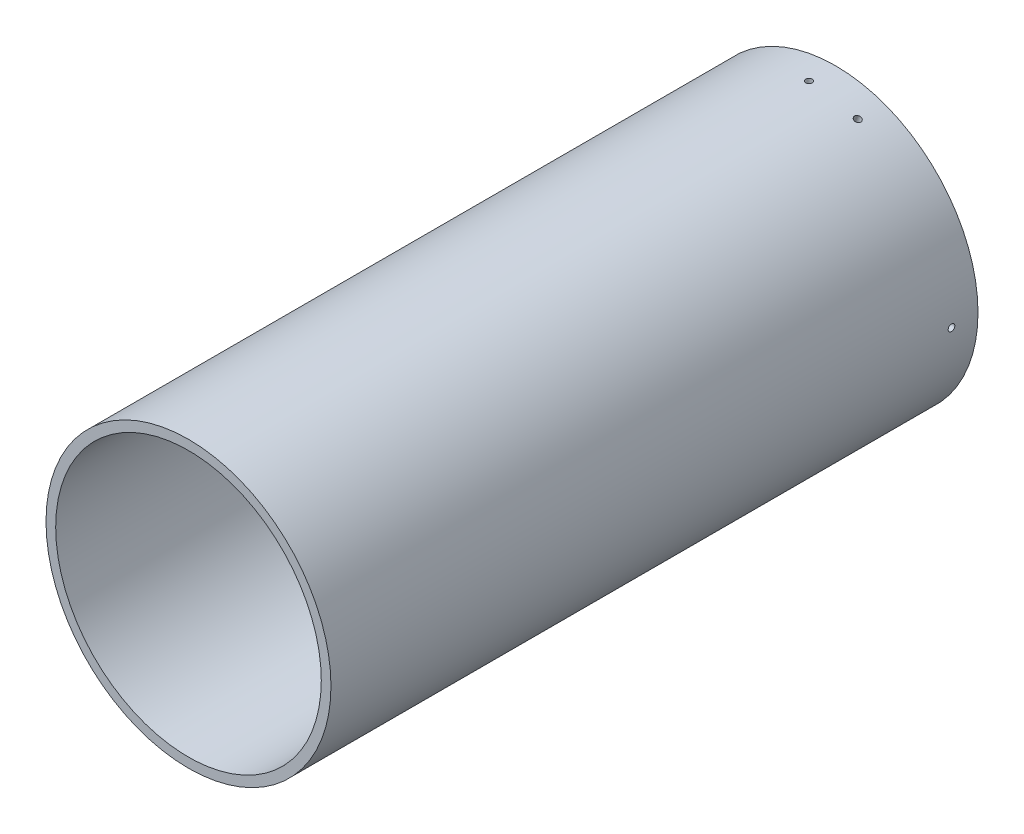
ISO-10303-21;
HEADER;
FILE_DESCRIPTION(('STEP AP214'),'2;1');
FILE_NAME('part.step','',(''),(''),'','','');
FILE_SCHEMA(('AUTOMOTIVE_DESIGN { 1 0 10303 214 1 1 1 1 }'));
ENDSEC;
DATA;
#1=APPLICATION_CONTEXT('core data for automotive mechanical design processes');
#2=APPLICATION_PROTOCOL_DEFINITION('international standard','automotive_design',2000,#1);
#3=PRODUCT_CONTEXT('',#1,'mechanical');
#4=PRODUCT('Part','Part','',(#3));
#5=PRODUCT_RELATED_PRODUCT_CATEGORY('part','',(#4));
#6=PRODUCT_DEFINITION_FORMATION('','',#4);
#7=PRODUCT_DEFINITION_CONTEXT('part definition',#1,'design');
#8=PRODUCT_DEFINITION('design','',#6,#7);
#9=PRODUCT_DEFINITION_SHAPE('','',#8);
#10=(LENGTH_UNIT() NAMED_UNIT(*) SI_UNIT(.MILLI.,.METRE.));
#11=(NAMED_UNIT(*) PLANE_ANGLE_UNIT() SI_UNIT($,.RADIAN.));
#12=(NAMED_UNIT(*) SI_UNIT($,.STERADIAN.) SOLID_ANGLE_UNIT());
#13=UNCERTAINTY_MEASURE_WITH_UNIT(LENGTH_MEASURE(1.E-05),#10,'distance_accuracy_value','');
#14=(GEOMETRIC_REPRESENTATION_CONTEXT(3) GLOBAL_UNCERTAINTY_ASSIGNED_CONTEXT((#13)) GLOBAL_UNIT_ASSIGNED_CONTEXT((#10,
#11,#12)) REPRESENTATION_CONTEXT('',''));
#15=CARTESIAN_POINT('',(0.,0.,0.));
#16=DIRECTION('',(0.,0.,1.));
#17=DIRECTION('',(1.,0.,0.));
#18=AXIS2_PLACEMENT_3D('',#15,#16,#17);
#19=CARTESIAN_POINT('',(0.,0.,-620.));
#20=DIRECTION('',(0.,0.,1.));
#21=DIRECTION('',(1.00000000000001,0.,0.));
#22=AXIS2_PLACEMENT_3D('',#19,#20,#21);
#23=CYLINDRICAL_SURFACE('',#22,127.254);
#24=CARTESIAN_POINT('',(0.,127.254,-597.775));
#25=CARTESIAN_POINT('',(-0.178311371915167,127.253999465741,-597.774992101748));
#26=CARTESIAN_POINT('',(-0.356751329955537,127.253621197047,-597.759928350951));
#27=CARTESIAN_POINT('',(-0.708714874695344,127.252148572495,-597.700046241203));
#28=CARTESIAN_POINT('',(-0.882232315195685,127.251053359268,-597.655192256247));
#29=CARTESIAN_POINT('',(-1.21920095496851,127.248270887799,-597.537009195012));
#30=CARTESIAN_POINT('',(-1.38265699815128,127.246583917112,-597.463693947191));
#31=CARTESIAN_POINT('',(-1.69489545361669,127.24280826828,-597.290689088388));
#32=CARTESIAN_POINT('',(-1.84368145618244,127.240719688795,-597.191005952673));
#33=CARTESIAN_POINT('',(-2.12245588922785,127.236375191238,-596.96805187711));
#34=CARTESIAN_POINT('',(-2.25243868642296,127.234119223322,-596.844773894033));
#35=CARTESIAN_POINT('',(-2.48986990687723,127.229694654503,-596.578140882044));
#36=CARTESIAN_POINT('',(-2.59731743655612,127.227526057067,-596.434785057371));
#37=CARTESIAN_POINT('',(-2.78663345093064,127.223520584226,-596.132049188842));
#38=CARTESIAN_POINT('',(-2.86849907298861,127.221683745955,-595.972667354298));
#39=CARTESIAN_POINT('',(-3.00430855695731,127.218549304123,-595.642416607317));
#40=CARTESIAN_POINT('',(-3.05825251362666,127.217251698731,-595.471547733868));
#41=CARTESIAN_POINT('',(-3.13667670821165,127.215342353072,-595.123211004342));
#42=CARTESIAN_POINT('',(-3.16116310484432,127.214730469441,-594.945744535632));
#43=CARTESIAN_POINT('',(-3.17999605185368,127.214261126643,-594.589218968986));
#44=CARTESIAN_POINT('',(-3.17434270218829,127.214403664974,-594.410159876335));
#45=CARTESIAN_POINT('',(-3.13306189941399,127.21542695871,-594.055573691623));
#46=CARTESIAN_POINT('',(-3.09744111820323,127.216307549796,-593.880045822284));
#47=CARTESIAN_POINT('',(-2.99724690549525,127.218707418542,-593.537462131791));
#48=CARTESIAN_POINT('',(-2.932673420475,127.220226697383,-593.3704063263));
#49=CARTESIAN_POINT('',(-2.77639915822136,127.223732858126,-593.049487508174));
#50=CARTESIAN_POINT('',(-2.6846953211523,127.225719792766,-592.895625986153));
#51=CARTESIAN_POINT('',(-2.47676580416428,127.229937214665,-592.605479712593));
#52=CARTESIAN_POINT('',(-2.36054008854463,127.232167702278,-592.469194986644));
#53=CARTESIAN_POINT('',(-2.10682827475089,127.236621511422,-592.218032040011));
#54=CARTESIAN_POINT('',(-1.96933638627736,127.238844830834,-592.103159668268));
#55=CARTESIAN_POINT('',(-1.677015586544,127.243033072694,-591.898127289998));
#56=CARTESIAN_POINT('',(-1.5221866726625,127.244997995103,-591.807967287208));
#57=CARTESIAN_POINT('',(-1.19958368008242,127.248447952227,-591.654919662928));
#58=CARTESIAN_POINT('',(-1.0318095159364,127.249932983774,-591.592032221474));
#59=CARTESIAN_POINT('',(-0.688080022678283,127.252255698325,-591.49531860039));
#60=CARTESIAN_POINT('',(-0.512124709082333,127.253093382556,-591.461492365645));
#61=CARTESIAN_POINT('',(-0.157078518899988,127.254026814594,-591.423868528123));
#62=CARTESIAN_POINT('',(0.0220114996610019,127.254122762339,-591.420062833123));
#63=CARTESIAN_POINT('',(0.378287965424347,127.253562434667,-591.442567023178));
#64=CARTESIAN_POINT('',(0.555474414125327,127.252906159841,-591.468876884522));
#65=CARTESIAN_POINT('',(0.902891470441027,127.250915487189,-591.550858643208));
#66=CARTESIAN_POINT('',(1.07312294466797,127.249581174129,-591.606526870307));
#67=CARTESIAN_POINT('',(1.40182433894853,127.246384805591,-591.745641399614));
#68=CARTESIAN_POINT('',(1.56029424311323,127.244522749401,-591.829087739349));
#69=CARTESIAN_POINT('',(1.86101133639457,127.240480211771,-592.021410589178));
#70=CARTESIAN_POINT('',(2.00325503981961,127.238299662142,-592.130292548067));
#71=CARTESIAN_POINT('',(2.26744693454755,127.233866141248,-592.370387857978));
#72=CARTESIAN_POINT('',(2.38939508747593,127.231613169847,-592.501601251223));
#73=CARTESIAN_POINT('',(2.60956115964657,127.22728822772,-592.782669386212));
#74=CARTESIAN_POINT('',(2.70777385747905,127.225216296883,-592.932528218682));
#75=CARTESIAN_POINT('',(2.87764537040289,127.221487663073,-593.246612292893));
#76=CARTESIAN_POINT('',(2.9493042355405,127.219830959317,-593.410837507558));
#77=CARTESIAN_POINT('',(3.06402482025312,127.21711985102,-593.748972876939));
#78=CARTESIAN_POINT('',(3.10708992878825,127.216065375106,-593.922881881274));
#79=CARTESIAN_POINT('',(3.16341166106635,127.214677409372,-594.275464580006));
#80=CARTESIAN_POINT('',(3.17666828635724,127.214343919517,-594.454138274155));
#81=CARTESIAN_POINT('',(3.17299631753776,127.214435552105,-594.81112596089));
#82=CARTESIAN_POINT('',(3.15607597378231,127.214860467203,-594.98944003845));
#83=CARTESIAN_POINT('',(3.09254730318569,127.216420571871,-595.340695857154));
#84=CARTESIAN_POINT('',(3.04593891719879,127.217555762856,-595.513637587594));
#85=CARTESIAN_POINT('',(2.92435799431519,127.220408422499,-595.849243543765));
#86=CARTESIAN_POINT('',(2.84938495960279,127.222125901377,-596.011907589059));
#87=CARTESIAN_POINT('',(2.67320678986864,127.225949439006,-596.322335600093));
#88=CARTESIAN_POINT('',(2.57200262853382,127.228055483335,-596.470100118612));
#89=CARTESIAN_POINT('',(2.34621453529119,127.232419254725,-596.74657013558));
#90=CARTESIAN_POINT('',(2.22162670259717,127.234677007054,-596.875272447716));
#91=CARTESIAN_POINT('',(1.9525760411969,127.239090001326,-597.109968554897));
#92=CARTESIAN_POINT('',(1.80810829314421,127.241245217719,-597.215956712603));
#93=CARTESIAN_POINT('',(1.50335191688865,127.245210797661,-597.402228528389));
#94=CARTESIAN_POINT('',(1.34305392106969,127.247020955142,-597.48249684596));
#95=CARTESIAN_POINT('',(1.01137679754223,127.250088498522,-597.614888686578));
#96=CARTESIAN_POINT('',(0.840011181128214,127.251346544333,-597.667045826609));
#97=CARTESIAN_POINT('',(0.556300072112094,127.252831277823,-597.727888294524));
#98=CARTESIAN_POINT('',(0.445796715096896,127.253267651215,-597.745533010283));
#99=CARTESIAN_POINT('',(0.223545754603567,127.253852179761,-597.769091337868));
#100=CARTESIAN_POINT('',(0.11179815137712,127.254000334972,-597.775004952068));
#101=CARTESIAN_POINT('',(0.,127.254,-597.775));
#102=B_SPLINE_CURVE_WITH_KNOTS('',3,(#24,#25,#26,#27,#28,#29,#30,#31,#32,#33,#34,#35,#36,#37,
#38,#39,#40,#41,#42,#43,#44,#45,#46,#47,#48,#49,#50,#51,#52,#53,#54,#55,#56,#57,#58,#59,#60,#61,
#62,#63,#64,#65,#66,#67,#68,#69,#70,#71,#72,#73,#74,#75,#76,#77,#78,#79,#80,#81,#82,#83,#84,#85,
#86,#87,#88,#89,#90,#91,#92,#93,#94,#95,#96,#97,#98,#99,#100,#101),.UNSPECIFIED.,.T.,.F.,(4,2,2,
2,2,2,2,2,2,2,2,2,2,2,2,2,2,2,2,2,2,2,2,2,2,2,2,2,2,2,2,2,2,2,2,2,2,2,4),(0.,0.534526042554034,
1.06969247616293,1.60459921353039,2.13937471346244,2.67431009736321,3.20926668879458,
3.74428312091419,4.27929773732011,4.81420047831677,5.3491014453192,5.88388335438326,
6.41866625206879,6.9535094870472,7.48835350069375,8.02334339749671,8.55833337519991,
9.09332688450241,9.62831937919146,10.1631676583764,10.69801551646,11.2327965262513,
11.7675782584745,12.3024746563392,12.8373720655664,13.3723870365372,13.9074009991551,
14.442351540068,14.9773020532017,15.5121063337886,16.0469116798379,16.5817264124604,
17.1165212958569,17.6514054713752,18.1864222444484,18.7217575349871,19.2564512119153,
19.5915898789918,19.9267284782782),.UNSPECIFIED.);
#103=CARTESIAN_POINT('',(0.,127.254,-597.775));
#104=VERTEX_POINT('',#103);
#105=EDGE_CURVE('E97',#104,#104,#102,.T.);
#106=ORIENTED_EDGE('',*,*,#105,.T.);
#107=EDGE_LOOP('',(#106));
#108=FACE_BOUND('',#107,.T.);
#109=CARTESIAN_POINT('',(0.,0.,-620.));
#110=DIRECTION('',(0.,0.,-1.));
#111=DIRECTION('',(-1.00000000000001,0.,0.));
#112=AXIS2_PLACEMENT_3D('',#109,#110,#111);
#113=CIRCLE('',#112,127.254);
#114=CARTESIAN_POINT('',(-127.254000000001,0.,-620.));
#115=VERTEX_POINT('',#114);
#116=EDGE_CURVE('E69',#115,#115,#113,.T.);
#117=ORIENTED_EDGE('',*,*,#116,.T.);
#118=EDGE_LOOP('',(#117));
#119=FACE_BOUND('',#118,.T.);
#120=CARTESIAN_POINT('',(0.,0.,0.));
#121=DIRECTION('',(0.,0.,-1.));
#122=DIRECTION('',(-1.00000000000001,0.,0.));
#123=AXIS2_PLACEMENT_3D('',#120,#121,#122);
#124=CIRCLE('',#123,127.254);
#125=CARTESIAN_POINT('',(-127.254000000001,0.,0.));
#126=VERTEX_POINT('',#125);
#127=EDGE_CURVE('E104',#126,#126,#124,.T.);
#128=ORIENTED_EDGE('',*,*,#127,.F.);
#129=EDGE_LOOP('',(#128));
#130=FACE_BOUND('',#129,.T.);
#131=CARTESIAN_POINT('',(46.4934064500755,118.456505404593,-594.6));
#132=CARTESIAN_POINT('',(46.4933992110869,118.456508608605,-594.421688637827));
#133=CARTESIAN_POINT('',(46.4793733340344,118.462016284329,-594.243248689495));
#134=CARTESIAN_POINT('',(46.4236063788353,118.483881389991,-593.891285164927));
#135=CARTESIAN_POINT('',(46.3818321164786,118.500251810628,-593.717767734898));
#136=CARTESIAN_POINT('',(46.2717282727177,118.543288095494,-593.380799117258));
#137=CARTESIAN_POINT('',(46.2034115876898,118.569948959783,-593.217343085648));
#138=CARTESIAN_POINT('',(46.0421317822682,118.63266863202,-592.905104649537));
#139=CARTESIAN_POINT('',(45.9491747128774,118.668725132621,-592.756318654767));
#140=CARTESIAN_POINT('',(45.7411524338012,118.74906268395,-592.47754421277));
#141=CARTESIAN_POINT('',(45.6260806197325,118.793346191472,-592.347561401332));
#142=CARTESIAN_POINT('',(45.3770407720111,118.888697642276,-592.110130153431));
#143=CARTESIAN_POINT('',(45.2430719894346,118.939765854444,-592.002682610504));
#144=CARTESIAN_POINT('',(44.9599630864623,119.047071023332,-591.813366582392));
#145=CARTESIAN_POINT('',(44.8108212721232,119.103308557098,-591.731500957379));
#146=CARTESIAN_POINT('',(44.501558893264,119.219205723865,-591.595691467171));
#147=CARTESIAN_POINT('',(44.3414383659907,119.278865345257,-591.541747507254));
#148=CARTESIAN_POINT('',(44.0147617718297,119.39979721429,-591.463323305712));
#149=CARTESIAN_POINT('',(43.848207057711,119.461069122099,-591.438836905145));
#150=CARTESIAN_POINT('',(43.5133431001269,119.583448945184,-591.420003948116));
#151=CARTESIAN_POINT('',(43.3450338624799,119.644556861004,-591.425657291739));
#152=CARTESIAN_POINT('',(43.0114819348402,119.764871197595,-591.46693808507));
#153=CARTESIAN_POINT('',(42.8462385712424,119.824078038194,-591.502558868961));
#154=CARTESIAN_POINT('',(42.5234945575337,119.938994034061,-591.602753098231));
#155=CARTESIAN_POINT('',(42.3659939217209,119.994703182872,-591.667326597073));
#156=CARTESIAN_POINT('',(42.0632298939628,120.101169813498,-591.823600887688));
#157=CARTESIAN_POINT('',(41.9179678832196,120.151926736528,-591.915304736027));
#158=CARTESIAN_POINT('',(41.6438772619478,120.247199925678,-592.123234276931));
#159=CARTESIAN_POINT('',(41.5150486753496,120.29171618271,-592.239460005203));
#160=CARTESIAN_POINT('',(41.277509424444,120.37343373999,-592.49317182782));
#161=CARTESIAN_POINT('',(41.1688042546334,120.410633042589,-592.63066370992));
#162=CARTESIAN_POINT('',(40.9747042527292,120.476822160319,-592.922984491604));
#163=CARTESIAN_POINT('',(40.8893094241887,120.505811974198,-593.07781339383));
#164=CARTESIAN_POINT('',(40.7443115223408,120.554914804678,-593.40041638358));
#165=CARTESIAN_POINT('',(40.6847086229282,120.57502776143,-593.568190558374));
#166=CARTESIAN_POINT('',(40.5930329246222,120.60592254969,-593.911920074728));
#167=CARTESIAN_POINT('',(40.5609600734591,120.616704398915,-594.087875400753));
#168=CARTESIAN_POINT('',(40.5252858940061,120.628695098982,-594.442921596194));
#169=CARTESIAN_POINT('',(40.5216768898872,120.629906530673,-594.622011607223));
#170=CARTESIAN_POINT('',(40.5430156233312,120.622736339382,-594.978288056369));
#171=CARTESIAN_POINT('',(40.5679633384112,120.614354723953,-595.155474495984));
#172=CARTESIAN_POINT('',(40.6456820301768,120.588186452441,-595.502891509749));
#173=CARTESIAN_POINT('',(40.6984495253932,120.570400973191,-595.673122951401));
#174=CARTESIAN_POINT('',(40.8302678536304,120.525825265571,-596.001824284557));
#175=CARTESIAN_POINT('',(40.9093187222071,120.499035025019,-596.16029416015));
#176=CARTESIAN_POINT('',(41.0914258673249,120.437055984086,-596.461011234773));
#177=CARTESIAN_POINT('',(41.1944872921617,120.401865382477,-596.603254944863));
#178=CARTESIAN_POINT('',(41.4216194778414,120.323914222022,-596.867446854851));
#179=CARTESIAN_POINT('',(41.5456902783785,120.281153648875,-596.989395016402));
#180=CARTESIAN_POINT('',(41.8112870417012,120.189086497478,-597.209561106057));
#181=CARTESIAN_POINT('',(41.9528168348517,120.139778482589,-597.307773812753));
#182=CARTESIAN_POINT('',(42.24923438241,120.035858572497,-597.477645341255));
#183=CARTESIAN_POINT('',(42.4041221116414,119.981246687291,-597.549304213106));
#184=CARTESIAN_POINT('',(42.7227924433027,119.868144561388,-597.664024802521));
#185=CARTESIAN_POINT('',(42.8865739882325,119.809654781601,-597.707089911945));
#186=CARTESIAN_POINT('',(43.2183678962244,119.690368281186,-597.763411650165));
#187=CARTESIAN_POINT('',(43.386380259076,119.629571560671,-597.776668280444));
#188=CARTESIAN_POINT('',(43.7218076326029,119.507388498268,-597.772996325681));
#189=CARTESIAN_POINT('',(43.8892227939149,119.446002321977,-597.756075985077));
#190=CARTESIAN_POINT('',(44.2187619067614,119.324400148653,-597.692547312688));
#191=CARTESIAN_POINT('',(44.380885847761,119.26418415395,-597.645938921799));
#192=CARTESIAN_POINT('',(44.6952768970721,119.146720157614,-597.524357980715));
#193=CARTESIAN_POINT('',(44.8475438323461,119.089472208087,-597.449384932744));
#194=CARTESIAN_POINT('',(45.137943261258,118.979707184252,-597.273206729701));
#195=CARTESIAN_POINT('',(45.2760762792873,118.927189934434,-597.172002548339));
#196=CARTESIAN_POINT('',(45.534380706885,118.828531271126,-596.946214433618));
#197=CARTESIAN_POINT('',(45.6545491171387,118.782390922399,-596.821626604011));
#198=CARTESIAN_POINT('',(45.8735818934176,118.697973103215,-596.552575954915));
#199=CARTESIAN_POINT('',(45.9724409707581,118.659697584811,-596.408108216047));
#200=CARTESIAN_POINT('',(46.1461227075132,118.592261922147,-596.103351846709));
#201=CARTESIAN_POINT('',(46.2209310195165,118.56310721916,-595.943053846994));
#202=CARTESIAN_POINT('',(46.3442892505683,118.514943347549,-595.611376715098));
#203=CARTESIAN_POINT('',(46.3928705335871,118.495922061094,-595.440011094234));
#204=CARTESIAN_POINT('',(46.4495357884461,118.473717125923,-595.156299995308));
#205=CARTESIAN_POINT('',(46.4659670997292,118.467272099452,-595.045796653607));
#206=CARTESIAN_POINT('',(46.487904698798,118.45866523479,-594.823545723821));
#207=CARTESIAN_POINT('',(46.4934109887959,118.456503395732,-594.711798135988));
#208=CARTESIAN_POINT('',(46.4934064500755,118.456505404593,-594.6));
#209=B_SPLINE_CURVE_WITH_KNOTS('',3,(#131,#132,#133,#134,#135,#136,#137,#138,#139,#140,#141,
#142,#143,#144,#145,#146,#147,#148,#149,#150,#151,#152,#153,#154,#155,#156,#157,#158,#159,#160,
#161,#162,#163,#164,#165,#166,#167,#168,#169,#170,#171,#172,#173,#174,#175,#176,#177,#178,#179,
#180,#181,#182,#183,#184,#185,#186,#187,#188,#189,#190,#191,#192,#193,#194,#195,#196,#197,#198,
#199,#200,#201,#202,#203,#204,#205,#206,#207,#208),.UNSPECIFIED.,.T.,.F.,(4,2,2,2,2,2,2,2,2,2,2,
2,2,2,2,2,2,2,2,2,2,2,2,2,2,2,2,2,2,2,2,2,2,2,2,2,2,2,4),(0.,0.534526013298039,1.06969241828614,
1.60459912228169,2.13937458935585,2.67431001152299,3.20926664018673,3.74428305800291,
4.27929766079595,4.81420038408428,5.34910133411118,5.88388333469987,6.41866632280992,
6.95350958376681,7.48835362355204,8.02334348242965,8.55833342285519,9.09332697024389,
9.62831950186587,10.1631677574307,10.6980155919091,11.2327965094523,11.7675781504451,
12.3024745639584,12.83737198809,13.3723869738909,13.9074009513419,14.4423514528018,
14.9773019276463,15.5121062748236,16.046911686719,16.5817264844576,17.1165214324901,
17.651405568732,18.1864223034335,18.7217576110731,19.2564513041308,19.5915899251137,
19.9267284782366),.UNSPECIFIED.);
#210=CARTESIAN_POINT('',(46.4934064500755,118.456505404593,-594.6));
#211=VERTEX_POINT('',#210);
#212=EDGE_CURVE('E105',#211,#211,#209,.T.);
#213=ORIENTED_EDGE('',*,*,#212,.F.);
#214=EDGE_LOOP('',(#213));
#215=FACE_BOUND('',#214,.T.);
#216=CARTESIAN_POINT('',(127.254,0.,-597.775));
#217=CARTESIAN_POINT('',(127.253999465741,0.178311371915148,-597.774992101748));
#218=CARTESIAN_POINT('',(127.253621197047,0.356751329955512,-597.759928350951));
#219=CARTESIAN_POINT('',(127.252148572495,0.708714874695317,-597.700046241203));
#220=CARTESIAN_POINT('',(127.251053359268,0.882232315195663,-597.655192256247));
#221=CARTESIAN_POINT('',(127.248270887799,1.21920095496849,-597.537009195012));
#222=CARTESIAN_POINT('',(127.246583917112,1.38265699815127,-597.463693947191));
#223=CARTESIAN_POINT('',(127.24280826828,1.69489545361665,-597.290689088388));
#224=CARTESIAN_POINT('',(127.240719688795,1.84368145618237,-597.191005952673));
#225=CARTESIAN_POINT('',(127.236375191238,2.12245588922782,-596.968051877111));
#226=CARTESIAN_POINT('',(127.234119223322,2.25243868642298,-596.844773894033));
#227=CARTESIAN_POINT('',(127.229694654503,2.48986990687731,-596.578140882044));
#228=CARTESIAN_POINT('',(127.227526057067,2.59731743655619,-596.434785057371));
#229=CARTESIAN_POINT('',(127.223520584226,2.7866334509307,-596.132049188842));
#230=CARTESIAN_POINT('',(127.221683745955,2.86849907298865,-595.972667354298));
#231=CARTESIAN_POINT('',(127.218549304123,3.00430855695737,-595.642416607317));
#232=CARTESIAN_POINT('',(127.217251698732,3.05825251362674,-595.471547733868));
#233=CARTESIAN_POINT('',(127.215342353072,3.13667670821171,-595.123211004342));
#234=CARTESIAN_POINT('',(127.214730469441,3.16116310484436,-594.945744535632));
#235=CARTESIAN_POINT('',(127.214261126643,3.17999605185372,-594.589218968986));
#236=CARTESIAN_POINT('',(127.214403664974,3.17434270218836,-594.410159876335));
#237=CARTESIAN_POINT('',(127.21542695871,3.13306189941405,-594.055573691623));
#238=CARTESIAN_POINT('',(127.216307549796,3.09744111820324,-593.880045822284));
#239=CARTESIAN_POINT('',(127.218707418542,2.99724690549525,-593.537462131791));
#240=CARTESIAN_POINT('',(127.220226697383,2.93267342047506,-593.3704063263));
#241=CARTESIAN_POINT('',(127.223732858126,2.77639915822144,-593.049487508174));
#242=CARTESIAN_POINT('',(127.225719792766,2.68469532115232,-592.895625986153));
#243=CARTESIAN_POINT('',(127.229937214665,2.47676580416428,-592.605479712593));
#244=CARTESIAN_POINT('',(127.232167702278,2.36054008854468,-592.469194986644));
#245=CARTESIAN_POINT('',(127.236621511423,2.10682827475099,-592.21803204001));
#246=CARTESIAN_POINT('',(127.238844830834,1.96933638627745,-592.103159668268));
#247=CARTESIAN_POINT('',(127.243033072694,1.67701558654409,-591.898127289998));
#248=CARTESIAN_POINT('',(127.244997995104,1.52218667266261,-591.807967287208));
#249=CARTESIAN_POINT('',(127.248447952228,1.19958368008252,-591.654919662928));
#250=CARTESIAN_POINT('',(127.249932983774,1.03180951593647,-591.592032221474));
#251=CARTESIAN_POINT('',(127.252255698325,0.688080022678283,-591.49531860039));
#252=CARTESIAN_POINT('',(127.253093382557,0.512124709082306,-591.461492365645));
#253=CARTESIAN_POINT('',(127.254026814594,0.157078518899942,-591.423868528123));
#254=CARTESIAN_POINT('',(127.254122762339,-0.0220114996610399,-591.420062833123));
#255=CARTESIAN_POINT('',(127.253562434667,-0.378287965424374,-591.442567023178));
#256=CARTESIAN_POINT('',(127.252906159841,-0.555474414125351,-591.468876884522));
#257=CARTESIAN_POINT('',(127.250915487189,-0.902891470441055,-591.550858643208));
#258=CARTESIAN_POINT('',(127.249581174129,-1.07312294466801,-591.606526870306));
#259=CARTESIAN_POINT('',(127.246384805591,-1.40182433894857,-591.745641399614));
#260=CARTESIAN_POINT('',(127.244522749401,-1.56029424311327,-591.829087739349));
#261=CARTESIAN_POINT('',(127.240480211771,-1.86101133639464,-592.021410589178));
#262=CARTESIAN_POINT('',(127.238299662141,-2.0032550398197,-592.130292548067));
#263=CARTESIAN_POINT('',(127.233866141249,-2.26744693454767,-592.370387857978));
#264=CARTESIAN_POINT('',(127.231613169848,-2.38939508747605,-592.501601251223));
#265=CARTESIAN_POINT('',(127.227288227721,-2.6095611596467,-592.782669386212));
#266=CARTESIAN_POINT('',(127.225216296884,-2.70777385747918,-592.932528218682));
#267=CARTESIAN_POINT('',(127.221487663073,-2.87764537040298,-593.246612292893));
#268=CARTESIAN_POINT('',(127.219830959317,-2.94930423554056,-593.410837507558));
#269=CARTESIAN_POINT('',(127.21711985102,-3.06402482025321,-593.748972876939));
#270=CARTESIAN_POINT('',(127.216065375105,-3.1070899287884,-593.922881881274));
#271=CARTESIAN_POINT('',(127.214677409372,-3.16341166106646,-594.275464580006));
#272=CARTESIAN_POINT('',(127.214343919517,-3.17666828635726,-594.454138274155));
#273=CARTESIAN_POINT('',(127.214435552106,-3.1729963175378,-594.81112596089));
#274=CARTESIAN_POINT('',(127.214860467203,-3.15607597378246,-594.98944003845));
#275=CARTESIAN_POINT('',(127.216420571871,-3.09254730318584,-595.340695857154));
#276=CARTESIAN_POINT('',(127.217555762856,-3.04593891719879,-595.513637587594));
#277=CARTESIAN_POINT('',(127.220408422499,-2.92435799431513,-595.849243543765));
#278=CARTESIAN_POINT('',(127.222125901377,-2.84938495960283,-596.011907589059));
#279=CARTESIAN_POINT('',(127.225949439006,-2.67320678986874,-596.322335600093));
#280=CARTESIAN_POINT('',(127.228055483335,-2.5720026285339,-596.470100118612));
#281=CARTESIAN_POINT('',(127.232419254725,-2.34621453529122,-596.74657013558));
#282=CARTESIAN_POINT('',(127.234677007054,-2.22162670259718,-596.875272447716));
#283=CARTESIAN_POINT('',(127.239090001326,-1.95257604119682,-597.109968554898));
#284=CARTESIAN_POINT('',(127.241245217719,-1.80810829314408,-597.215956712603));
#285=CARTESIAN_POINT('',(127.245210797661,-1.50335191688848,-597.402228528389));
#286=CARTESIAN_POINT('',(127.247020955142,-1.34305392106954,-597.48249684596));
#287=CARTESIAN_POINT('',(127.250088498522,-1.01137679754214,-597.614888686578));
#288=CARTESIAN_POINT('',(127.251346544333,-0.840011181128174,-597.667045826609));
#289=CARTESIAN_POINT('',(127.252831277823,-0.556300072112094,-597.727888294524));
#290=CARTESIAN_POINT('',(127.253267651215,-0.445796715096902,-597.745533010283));
#291=CARTESIAN_POINT('',(127.253852179761,-0.223545754603579,-597.769091337868));
#292=CARTESIAN_POINT('',(127.254000334972,-0.111798151377133,-597.775004952068));
#293=CARTESIAN_POINT('',(127.254,0.,-597.775));
#294=B_SPLINE_CURVE_WITH_KNOTS('',3,(#216,#217,#218,#219,#220,#221,#222,#223,#224,#225,#226,
#227,#228,#229,#230,#231,#232,#233,#234,#235,#236,#237,#238,#239,#240,#241,#242,#243,#244,#245,
#246,#247,#248,#249,#250,#251,#252,#253,#254,#255,#256,#257,#258,#259,#260,#261,#262,#263,#264,
#265,#266,#267,#268,#269,#270,#271,#272,#273,#274,#275,#276,#277,#278,#279,#280,#281,#282,#283,
#284,#285,#286,#287,#288,#289,#290,#291,#292,#293),.UNSPECIFIED.,.T.,.F.,(4,2,2,2,2,2,2,2,2,2,2,
2,2,2,2,2,2,2,2,2,2,2,2,2,2,2,2,2,2,2,2,2,2,2,2,2,2,2,4),(0.,0.534526042554028,1.06969247616288,
1.6045992135304,2.13937471346242,2.67431009736319,3.20926668879467,3.74428312091426,
4.27929773732029,4.81420047831684,5.34910144531927,5.88388335438356,6.41866625206885,
6.95350948704751,7.4883535006939,8.02334339749678,8.55833337519997,9.09332688450253,
9.62831937919171,10.1631676583766,10.6980155164602,11.2327965262515,11.7675782584748,
12.3024746563395,12.8373720655667,13.3723870365375,13.9074009991553,14.4423515400683,
14.977302053202,15.5121063337887,16.0469116798383,16.5817264124608,17.1165212958573,
17.6514054713758,18.186422244449,18.7217575349877,19.2564512119157,19.5915898789922,
19.9267284782786),.UNSPECIFIED.);
#295=CARTESIAN_POINT('',(127.254,0.,-597.775));
#296=VERTEX_POINT('',#295);
#297=EDGE_CURVE('E140',#296,#296,#294,.T.);
#298=ORIENTED_EDGE('',*,*,#297,.T.);
#299=EDGE_LOOP('',(#298));
#300=FACE_BOUND('',#299,.T.);
#301=ADVANCED_FACE('F49',(#108,#119,#130,#215,#300),#23,.F.);
#302=CARTESIAN_POINT('',(0.,0.,-620.));
#303=DIRECTION('',(0.,0.,1.));
#304=DIRECTION('',(1.00000000000001,0.,0.));
#305=AXIS2_PLACEMENT_3D('',#302,#303,#304);
#306=CYLINDRICAL_SURFACE('',#305,136.525);
#307=CARTESIAN_POINT('',(49.6651955243542,127.170924265446,-594.6));
#308=CARTESIAN_POINT('',(49.665188271704,127.17092743588,-594.421684730115));
#309=CARTESIAN_POINT('',(49.6511529886347,127.176411191632,-594.243240778555));
#310=CARTESIAN_POINT('',(49.5953492258003,127.198183252112,-593.891269089723));
#311=CARTESIAN_POINT('',(49.5535475172643,127.214484502381,-593.717747502914));
#312=CARTESIAN_POINT('',(49.443373405497,127.257345270252,-593.380770550486));
#313=CARTESIAN_POINT('',(49.3750138782201,127.283899816739,-593.217310351252));
#314=CARTESIAN_POINT('',(49.2136374308615,127.346381833105,-592.905064406455));
#315=CARTESIAN_POINT('',(49.1206265746477,127.382306997914,-592.756275064406));
#316=CARTESIAN_POINT('',(48.9124941677814,127.462370673568,-592.477498993973));
#317=CARTESIAN_POINT('',(48.7973665748192,127.506511428815,-592.347517420938));
#318=CARTESIAN_POINT('',(48.5482174005207,127.601582877361,-592.110089546693));
#319=CARTESIAN_POINT('',(48.4141950712953,127.652513839424,-592.002644137924));
#320=CARTESIAN_POINT('',(48.1309899322202,127.759564482317,-591.813334961994));
#321=CARTESIAN_POINT('',(47.9818056886749,127.815684653788,-591.731473617024));
#322=CARTESIAN_POINT('',(47.6724723282147,127.931381012808,-591.595672360405));
#323=CARTESIAN_POINT('',(47.5123232465107,127.990957189258,-591.541732359097));
#324=CARTESIAN_POINT('',(47.1856020745443,128.111767200576,-591.463314191705));
#325=CARTESIAN_POINT('',(47.0190311549398,128.173000732718,-591.438830681862));
#326=CARTESIAN_POINT('',(46.6841528944705,128.295351698927,-591.42000405785));
#327=CARTESIAN_POINT('',(46.515845559019,128.356469133357,-591.425660849744));
#328=CARTESIAN_POINT('',(46.1823100246407,128.476851234904,-591.466949666166));
#329=CARTESIAN_POINT('',(46.0170812372478,128.536116257611,-591.50257590067));
#330=CARTESIAN_POINT('',(45.6943820596355,128.651189027756,-591.602783360361));
#331=CARTESIAN_POINT('',(45.5369116829409,128.706996769168,-591.667364636023));
#332=CARTESIAN_POINT('',(45.23422271914,128.813689117163,-591.823655581277));
#333=CARTESIAN_POINT('',(45.0890053330325,128.864573241221,-591.915367906208));
#334=CARTESIAN_POINT('',(44.8150113528957,128.960115808825,-592.123315550062));
#335=CARTESIAN_POINT('',(44.6862347787942,129.004774244826,-592.239550898711));
#336=CARTESIAN_POINT('',(44.4488059455258,129.086773495686,-592.493277884052));
#337=CARTESIAN_POINT('',(44.34015846075,129.124112574598,-592.630774549535));
#338=CARTESIAN_POINT('',(44.1461686465744,129.190564544392,-592.923103353786));
#339=CARTESIAN_POINT('',(44.0608263206502,129.219677434047,-593.07793549514));
#340=CARTESIAN_POINT('',(43.9159228222214,129.268995645167,-593.400542881935));
#341=CARTESIAN_POINT('',(43.8563617993527,129.289200914932,-593.568318202494));
#342=CARTESIAN_POINT('',(43.7647546736914,129.320239067569,-593.912048086431));
#343=CARTESIAN_POINT('',(43.7327085253575,129.331071965954,-594.088002636271));
#344=CARTESIAN_POINT('',(43.6970692671294,129.343117807886,-594.443052039056));
#345=CARTESIAN_POINT('',(43.6934694924575,129.344333004791,-594.62214614657));
#346=CARTESIAN_POINT('',(43.7148103807532,129.337121896126,-594.978429566759));
#347=CARTESIAN_POINT('',(43.7397510243702,129.328695597094,-595.155618880726));
#348=CARTESIAN_POINT('',(43.8174415885165,129.302394030108,-595.503043298412));
#349=CARTESIAN_POINT('',(43.8701884872819,129.284519788882,-595.673279155612));
#350=CARTESIAN_POINT('',(44.0019552934877,129.239732163256,-596.001987337585));
#351=CARTESIAN_POINT('',(44.0809752313663,129.212818768384,-596.16045964873));
#352=CARTESIAN_POINT('',(44.2630121003195,129.150573379819,-596.461174644736));
#353=CARTESIAN_POINT('',(44.3660335031176,129.115239817333,-596.603414297918));
#354=CARTESIAN_POINT('',(44.5930836357899,129.036998170046,-596.867595850836));
#355=CARTESIAN_POINT('',(44.7171124012575,128.994090072413,-596.989537716181));
#356=CARTESIAN_POINT('',(44.9826243724501,128.90174107403,-597.209685592021));
#357=CARTESIAN_POINT('',(45.1241109066385,128.852298927383,-597.307887065626));
#358=CARTESIAN_POINT('',(45.4204490919326,128.748138096074,-597.477735493639));
#359=CARTESIAN_POINT('',(45.5753007192982,128.693419420783,-597.549382495213));
#360=CARTESIAN_POINT('',(45.8939127094672,128.580142172181,-597.664080253443));
#361=CARTESIAN_POINT('',(46.057672151441,128.521583995644,-597.707133959825));
#362=CARTESIAN_POINT('',(46.3894364132855,128.402207464047,-597.763432677391));
#363=CARTESIAN_POINT('',(46.5574412339767,128.341389108552,-597.776677682814));
#364=CARTESIAN_POINT('',(46.8928753295958,128.219209647708,-597.772982632726));
#365=CARTESIAN_POINT('',(47.060304731774,128.157848674734,-597.756049747535));
#366=CARTESIAN_POINT('',(47.3898869091543,128.036342904609,-597.692494278472));
#367=CARTESIAN_POINT('',(47.5520396738344,127.976198109883,-597.645871635401));
#368=CARTESIAN_POINT('',(47.8664997647459,127.858914475175,-597.524260642615));
#369=CARTESIAN_POINT('',(48.0188069161029,127.801775688588,-597.44927178923));
#370=CARTESIAN_POINT('',(48.3092930860103,127.692254867896,-597.273060796344));
#371=CARTESIAN_POINT('',(48.4474726326859,127.639872655987,-597.171839637971));
#372=CARTESIAN_POINT('',(48.7058657499868,127.541496846399,-596.946021140067));
#373=CARTESIAN_POINT('',(48.826076961271,127.495504087746,-596.821420735547));
#374=CARTESIAN_POINT('',(49.0451909001101,127.411375825742,-596.552346811115));
#375=CARTESIAN_POINT('',(49.1440883360783,127.373242273704,-596.407868370621));
#376=CARTESIAN_POINT('',(49.3178355717975,127.306069882579,-596.103095632807));
#377=CARTESIAN_POINT('',(49.3926713933164,127.277036330245,-595.942792212618));
#378=CARTESIAN_POINT('',(49.516071355328,127.229079722087,-595.61110774376));
#379=CARTESIAN_POINT('',(49.5646668907812,127.210144584438,-595.439740208848));
#380=CARTESIAN_POINT('',(49.6213339494035,127.188047196782,-595.156071920438));
#381=CARTESIAN_POINT('',(49.6377618407411,127.181635330736,-595.045613206753));
#382=CARTESIAN_POINT('',(49.6596948999099,127.173072871972,-594.823453175772));
#383=CARTESIAN_POINT('',(49.6652000696583,127.170922278506,-594.711751858695));
#384=CARTESIAN_POINT('',(49.6651955243542,127.170924265446,-594.6));
#385=B_SPLINE_CURVE_WITH_KNOTS('',3,(#307,#308,#309,#310,#311,#312,#313,#314,#315,#316,#317,
#318,#319,#320,#321,#322,#323,#324,#325,#326,#327,#328,#329,#330,#331,#332,#333,#334,#335,#336,
#337,#338,#339,#340,#341,#342,#343,#344,#345,#346,#347,#348,#349,#350,#351,#352,#353,#354,#355,
#356,#357,#358,#359,#360,#361,#362,#363,#364,#365,#366,#367,#368,#369,#370,#371,#372,#373,#374,
#375,#376,#377,#378,#379,#380,#381,#382,#383,#384),.UNSPECIFIED.,.T.,.F.,(4,2,2,2,2,2,2,2,2,2,2,
2,2,2,2,2,2,2,2,2,2,2,2,2,2,2,2,2,2,2,2,2,2,2,2,2,2,2,4),(0.,0.534537906723594,1.06971666351802,
1.60463627421613,2.13942442440857,2.67435888745705,3.20931453016475,3.74432080489701,
4.27932536166386,4.81423284760597,5.34913866641805,5.88394116641403,6.41874459867059,
6.95360038989537,7.48845682940755,8.02343996882172,8.55842318801741,9.09340951223746,
9.62839495097272,10.163255042809,10.6981147720067,11.2329163888578,11.7677186252962,
12.3026205807667,12.8375234425417,13.37252844587,13.907532498899,14.4424813515419,
14.9774303075732,15.5122521757553,16.0470751103331,16.5819075416445,17.1167199722703,
17.6516025651341,18.186617801101,18.7219432868748,19.2566268599673,19.5916268582412,
19.9266267977175),.UNSPECIFIED.);
#386=CARTESIAN_POINT('',(49.6651955243542,127.170924265446,-594.6));
#387=VERTEX_POINT('',#386);
#388=EDGE_CURVE('E78',#387,#387,#385,.T.);
#389=ORIENTED_EDGE('',*,*,#388,.T.);
#390=EDGE_LOOP('',(#389));
#391=FACE_BOUND('',#390,.T.);
#392=CARTESIAN_POINT('',(0.,0.,-620.));
#393=DIRECTION('',(0.,0.,-1.));
#394=DIRECTION('',(-1.00000000000001,0.,0.));
#395=AXIS2_PLACEMENT_3D('',#392,#393,#394);
#396=CIRCLE('',#395,136.525);
#397=CARTESIAN_POINT('',(-136.525000000001,0.,-620.));
#398=VERTEX_POINT('',#397);
#399=EDGE_CURVE('E64',#398,#398,#396,.T.);
#400=ORIENTED_EDGE('',*,*,#399,.F.);
#401=EDGE_LOOP('',(#400));
#402=FACE_BOUND('',#401,.T.);
#403=CARTESIAN_POINT('',(0.,0.,0.));
#404=DIRECTION('',(0.,0.,-1.));
#405=DIRECTION('',(-1.00000000000001,0.,0.));
#406=AXIS2_PLACEMENT_3D('',#403,#404,#405);
#407=CIRCLE('',#406,136.525);
#408=CARTESIAN_POINT('',(-136.525000000001,0.,0.));
#409=VERTEX_POINT('',#408);
#410=EDGE_CURVE('E76',#409,#409,#407,.T.);
#411=ORIENTED_EDGE('',*,*,#410,.T.);
#412=EDGE_LOOP('',(#411));
#413=FACE_BOUND('',#412,.T.);
#414=CARTESIAN_POINT('',(0.,136.525000000001,-597.775));
#415=CARTESIAN_POINT('',(-0.178315277239154,136.524999501849,-597.774992100393));
#416=CARTESIAN_POINT('',(-0.356759236126942,136.524646904631,-597.759927692333));
#417=CARTESIAN_POINT('',(-0.708730940184897,136.523274220773,-597.700042819738));
#418=CARTESIAN_POINT('',(-0.882252534897307,136.522253334396,-597.65518670276));
#419=CARTESIAN_POINT('',(-1.21922950403186,136.519659699562,-597.536997645325));
#420=CARTESIAN_POINT('',(-1.38268971200125,136.518087218565,-597.463678504338));
#421=CARTESIAN_POINT('',(-1.69493567140765,136.514567828377,-597.290664120916));
#422=CARTESIAN_POINT('',(-1.84372501934035,136.5126210113,-597.190975365053));
#423=CARTESIAN_POINT('',(-2.12250108301599,136.508571482114,-596.968011477682));
#424=CARTESIAN_POINT('',(-2.25248264529978,136.506468727516,-596.844729902995));
#425=CARTESIAN_POINT('',(-2.48991049882781,136.50234469672,-596.578089921083));
#426=CARTESIAN_POINT('',(-2.59735589759639,136.500323423752,-596.43473071912));
#427=CARTESIAN_POINT('',(-2.7866650631575,136.496590145433,-596.131991469361));
#428=CARTESIAN_POINT('',(-2.86852640589709,136.494878169396,-595.972609905358));
#429=CARTESIAN_POINT('',(-3.00432765780798,136.491956834022,-595.642361139277));
#430=CARTESIAN_POINT('',(-3.05826765666452,136.490747473071,-595.471493974092));
#431=CARTESIAN_POINT('',(-3.1366858188052,136.488967984748,-595.123157035236));
#432=CARTESIAN_POINT('',(-3.16116932567714,136.488397741437,-594.945688465125));
#433=CARTESIAN_POINT('',(-3.17999594212559,136.487960434682,-594.589159330767));
#434=CARTESIAN_POINT('',(-3.17433914567071,136.488093369045,-594.410098771485));
#435=CARTESIAN_POINT('',(-3.13305032212114,136.489047318788,-594.055504807807));
#436=CARTESIAN_POINT('',(-3.09742408964134,136.489868201153,-593.87997072828));
#437=CARTESIAN_POINT('',(-2.99721664245373,136.492105295984,-593.537375534538));
#438=CARTESIAN_POINT('',(-2.93263537722711,136.493521509488,-593.370314435108));
#439=CARTESIAN_POINT('',(-2.77634445338135,136.496789764168,-593.049388945101));
#440=CARTESIAN_POINT('',(-2.68463213695736,136.498641848037,-592.895525849331));
#441=CARTESIAN_POINT('',(-2.47668451115207,136.502573003636,-592.605378253298));
#442=CARTESIAN_POINT('',(-2.36044917205266,136.504652075641,-592.46909377434));
#443=CARTESIAN_POINT('',(-2.106722193369,136.508803416896,-592.217938245083));
#444=CARTESIAN_POINT('',(-1.96922552307478,136.510875684417,-592.103072276913));
#445=CARTESIAN_POINT('',(-1.6768967052004,136.514779323885,-591.898053547222));
#446=CARTESIAN_POINT('',(-1.52206455505085,136.516610695797,-591.807900789365));
#447=CARTESIAN_POINT('',(-1.19945716612136,136.51982610252,-591.654868212915));
#448=CARTESIAN_POINT('',(-1.0316818536014,136.521210134782,-591.591988549716));
#449=CARTESIAN_POINT('',(-0.68795198709972,136.523374794965,-591.495290333309));
#450=CARTESIAN_POINT('',(-0.511997446643058,136.524155423883,-591.461471732047));
#451=CARTESIAN_POINT('',(-0.156948047823831,136.525025149747,-591.423861853394));
#452=CARTESIAN_POINT('',(0.0221460653794839,136.525114408616,-591.420063545032));
#453=CARTESIAN_POINT('',(0.3784294981201,136.524591760825,-591.442583757041));
#454=CARTESIAN_POINT('',(0.555618818948822,136.523979854639,-591.468902256993));
#455=CARTESIAN_POINT('',(0.903043268756018,136.522123953694,-591.55090317372));
#456=CARTESIAN_POINT('',(1.07327915054385,136.520880027557,-591.606582402649));
#457=CARTESIAN_POINT('',(1.40198737865276,136.517900286919,-591.745720990187));
#458=CARTESIAN_POINT('',(1.56045971136203,136.516164471848,-591.829180380941));
#459=CARTESIAN_POINT('',(1.86117472144546,136.512396154734,-592.021528281944));
#460=CARTESIAN_POINT('',(2.00341436959212,136.510363597475,-592.130421526965));
#461=CARTESIAN_POINT('',(2.26759591098477,136.506231083517,-592.370539083627));
#462=CARTESIAN_POINT('',(2.38953776981777,136.504131126705,-592.501763433128));
#463=CARTESIAN_POINT('',(2.60968563246182,136.500100095796,-592.782848287885));
#464=CARTESIAN_POINT('',(2.70788709937909,136.498169054025,-592.932712346997));
#465=CARTESIAN_POINT('',(2.87773551563827,136.494694076203,-593.246804247552));
#466=CARTESIAN_POINT('',(2.9493825121473,136.493150139464,-593.411032063481));
#467=CARTESIAN_POINT('',(3.06408026682792,136.490623673929,-593.749172504074));
#468=CARTESIAN_POINT('',(3.10713397253751,136.489641087268,-593.923084128479));
#469=CARTESIAN_POINT('',(3.16343268561533,136.48834794085,-594.275669755093));
#470=CARTESIAN_POINT('',(3.17667768727144,136.488037381222,-594.454343758214));
#471=CARTESIAN_POINT('',(3.17298262657358,136.488123324983,-594.811336532162));
#472=CARTESIAN_POINT('',(3.15604973900539,136.488519660308,-594.989655377338));
#473=CARTESIAN_POINT('',(3.09249427130148,136.489974360362,-595.340918703056));
#474=CARTESIAN_POINT('',(3.04587163193556,136.491032726412,-595.513863172877));
#475=CARTESIAN_POINT('',(2.92426065289358,136.493692158517,-595.849472330844));
#476=CARTESIAN_POINT('',(2.84927180951773,136.495293234209,-596.012136836389));
#477=CARTESIAN_POINT('',(2.67306084177255,136.498857512918,-596.322562844373));
#478=CARTESIAN_POINT('',(2.57183969851472,136.500820702391,-596.470324903891));
#479=CARTESIAN_POINT('',(2.34602121681743,136.504888292876,-596.746781519699));
#480=CARTESIAN_POINT('',(2.22142080996427,136.506992712399,-596.875473569173));
#481=CARTESIAN_POINT('',(1.95234687623802,136.511105887828,-597.11014690272));
#482=CARTESIAN_POINT('',(1.80786842880833,136.51311461988,-597.21612254697));
#483=CARTESIAN_POINT('',(1.50309568577362,136.516810510357,-597.40236586395));
#484=CARTESIAN_POINT('',(1.34279226853153,136.518497481654,-597.48261859528));
#485=CARTESIAN_POINT('',(1.01110780600028,136.521356119827,-597.614978760198));
#486=CARTESIAN_POINT('',(0.839740274453666,136.522528402182,-597.667119827589));
#487=CARTESIAN_POINT('',(0.556071978429917,136.52391153749,-597.727927204383));
#488=CARTESIAN_POINT('',(0.445613253181338,136.524317944965,-597.745557363704));
#489=CARTESIAN_POINT('',(0.22345319901473,136.524862332294,-597.769096235864));
#490=CARTESIAN_POINT('',(0.111751870314602,136.525000312197,-597.775004950759));
#491=CARTESIAN_POINT('',(0.,136.525000000001,-597.775));
#492=B_SPLINE_CURVE_WITH_KNOTS('',3,(#414,#415,#416,#417,#418,#419,#420,#421,#422,#423,#424,
#425,#426,#427,#428,#429,#430,#431,#432,#433,#434,#435,#436,#437,#438,#439,#440,#441,#442,#443,
#444,#445,#446,#447,#448,#449,#450,#451,#452,#453,#454,#455,#456,#457,#458,#459,#460,#461,#462,
#463,#464,#465,#466,#467,#468,#469,#470,#471,#472,#473,#474,#475,#476,#477,#478,#479,#480,#481,
#482,#483,#484,#485,#486,#487,#488,#489,#490,#491),.UNSPECIFIED.,.T.,.F.,(4,2,2,2,2,2,2,2,2,2,2,
2,2,2,2,2,2,2,2,2,2,2,2,2,2,2,2,2,2,2,2,2,2,2,2,2,2,2,4),(0.,0.534537928806827,1.06971670720512,
1.60463634309332,2.13942451808787,2.67435895225191,3.20931456685569,3.74432085238784,
4.27932541943331,4.81423291873771,5.34913875035887,5.88394118126687,6.41874454526608,
6.95360031688935,7.48845673667877,8.02343990471421,8.55842315204272,9.09340944751249,
9.62839485836755,10.1632549680444,10.6981147150712,11.232916401551,11.7677187068496,
12.3026206504966,12.8375235010101,13.3725284931581,13.9075325350041,14.4424814174204,
14.9774304023468,15.512252220249,16.0470751051089,16.5819074872856,17.1167198691387,
17.6516024916537,18.1866177565887,18.7219432294374,19.2566267903386,19.5916268234162,
19.9266267977491),.UNSPECIFIED.);
#493=CARTESIAN_POINT('',(0.,136.525000000001,-597.775));
#494=VERTEX_POINT('',#493);
#495=EDGE_CURVE('E60',#494,#494,#492,.T.);
#496=ORIENTED_EDGE('',*,*,#495,.F.);
#497=EDGE_LOOP('',(#496));
#498=FACE_BOUND('',#497,.T.);
#499=CARTESIAN_POINT('',(136.525000000001,0.,-591.425));
#500=CARTESIAN_POINT('',(136.524999501849,-0.178315277239182,-591.425007899607));
#501=CARTESIAN_POINT('',(136.524646904631,-0.356759236126979,-591.440072307667));
#502=CARTESIAN_POINT('',(136.523274220773,-0.708730940184956,-591.499957180262));
#503=CARTESIAN_POINT('',(136.522253334396,-0.88225253489738,-591.54481329724));
#504=CARTESIAN_POINT('',(136.519659699563,-1.21922950403195,-591.663002354675));
#505=CARTESIAN_POINT('',(136.518087218565,-1.38268971200134,-591.736321495662));
#506=CARTESIAN_POINT('',(136.514567828377,-1.69493567140772,-591.909335879084));
#507=CARTESIAN_POINT('',(136.5126210113,-1.84372501934041,-592.009024634947));
#508=CARTESIAN_POINT('',(136.508571482114,-2.12250108301606,-592.231988522318));
#509=CARTESIAN_POINT('',(136.506468727516,-2.25248264529989,-592.355270097005));
#510=CARTESIAN_POINT('',(136.50234469672,-2.48991049882791,-592.621910078917));
#511=CARTESIAN_POINT('',(136.500323423752,-2.59735589759644,-592.76526928088));
#512=CARTESIAN_POINT('',(136.496590145433,-2.78666506315754,-593.06800853064));
#513=CARTESIAN_POINT('',(136.494878169396,-2.86852640589717,-593.227390094642));
#514=CARTESIAN_POINT('',(136.491956834022,-3.0043276578081,-593.557638860723));
#515=CARTESIAN_POINT('',(136.490747473071,-3.05826765666463,-593.728506025908));
#516=CARTESIAN_POINT('',(136.488967984748,-3.13668581880531,-594.076842964764));
#517=CARTESIAN_POINT('',(136.488397741437,-3.16116932567725,-594.254311534875));
#518=CARTESIAN_POINT('',(136.487960434682,-3.17999594212568,-594.610840669233));
#519=CARTESIAN_POINT('',(136.488093369047,-3.17433914567077,-594.789901228515));
#520=CARTESIAN_POINT('',(136.48904731879,-3.13305032212119,-595.144495192193));
#521=CARTESIAN_POINT('',(136.489868201153,-3.0974240896414,-595.32002927172));
#522=CARTESIAN_POINT('',(136.492105295983,-2.99721664245378,-595.662624465462));
#523=CARTESIAN_POINT('',(136.493521509488,-2.93263537722717,-595.829685564892));
#524=CARTESIAN_POINT('',(136.496789764168,-2.77634445338139,-596.150611054899));
#525=CARTESIAN_POINT('',(136.498641848037,-2.68463213695736,-596.30447415067));
#526=CARTESIAN_POINT('',(136.502573003637,-2.47668451115208,-596.594621746702));
#527=CARTESIAN_POINT('',(136.504652075642,-2.36044917205271,-596.730906225661));
#528=CARTESIAN_POINT('',(136.508803416896,-2.10672219336908,-596.982061754917));
#529=CARTESIAN_POINT('',(136.510875684417,-1.96922552307484,-597.096927723088));
#530=CARTESIAN_POINT('',(136.514779323885,-1.67689670520042,-597.301946452778));
#531=CARTESIAN_POINT('',(136.516610695798,-1.52206455505083,-597.392099210635));
#532=CARTESIAN_POINT('',(136.519826102521,-1.19945716612131,-597.545131787085));
#533=CARTESIAN_POINT('',(136.521210134782,-1.03168185360137,-597.608011450284));
#534=CARTESIAN_POINT('',(136.523374794965,-0.687951987099752,-597.704709666692));
#535=CARTESIAN_POINT('',(136.524155423884,-0.511997446643131,-597.738528267953));
#536=CARTESIAN_POINT('',(136.525025149748,-0.156948047823921,-597.776138146606));
#537=CARTESIAN_POINT('',(136.525114408617,0.02214606537942,-597.779936454968));
#538=CARTESIAN_POINT('',(136.524591760824,0.378429498120087,-597.757416242959));
#539=CARTESIAN_POINT('',(136.523979854639,0.555618818948834,-597.731097743007));
#540=CARTESIAN_POINT('',(136.522123953695,0.903043268756025,-597.64909682628));
#541=CARTESIAN_POINT('',(136.520880027557,1.07327915054383,-597.593417597351));
#542=CARTESIAN_POINT('',(136.517900286919,1.40198737865272,-597.454279009813));
#543=CARTESIAN_POINT('',(136.516164471848,1.56045971136199,-597.370819619059));
#544=CARTESIAN_POINT('',(136.512396154734,1.86117472144547,-597.178471718056));
#545=CARTESIAN_POINT('',(136.510363597474,2.00341436959218,-597.069578473035));
#546=CARTESIAN_POINT('',(136.506231083518,2.26759591098491,-596.829460916373));
#547=CARTESIAN_POINT('',(136.504131126706,2.38953776981797,-596.698236566872));
#548=CARTESIAN_POINT('',(136.500100095797,2.60968563246199,-596.417151712115));
#549=CARTESIAN_POINT('',(136.498169054026,2.70788709937918,-596.267287653003));
#550=CARTESIAN_POINT('',(136.494694076203,2.87773551563828,-595.953195752448));
#551=CARTESIAN_POINT('',(136.493150139465,2.9493825121473,-595.788967936519));
#552=CARTESIAN_POINT('',(136.49062367393,3.06408026682793,-595.450827495926));
#553=CARTESIAN_POINT('',(136.489641087268,3.10713397253755,-595.276915871521));
#554=CARTESIAN_POINT('',(136.48834794085,3.16343268561541,-594.924330244907));
#555=CARTESIAN_POINT('',(136.488037381222,3.17667768727153,-594.745656241786));
#556=CARTESIAN_POINT('',(136.488123324983,3.17298262657366,-594.388663467838));
#557=CARTESIAN_POINT('',(136.488519660308,3.15604973900547,-594.210344622663));
#558=CARTESIAN_POINT('',(136.489974360362,3.09249427130158,-593.859081296944));
#559=CARTESIAN_POINT('',(136.491032726413,3.04587163193565,-593.686136827123));
#560=CARTESIAN_POINT('',(136.493692158518,2.92426065289364,-593.350527669156));
#561=CARTESIAN_POINT('',(136.495293234209,2.84927180951778,-593.187863163611));
#562=CARTESIAN_POINT('',(136.498857512918,2.67306084177258,-592.877437155627));
#563=CARTESIAN_POINT('',(136.500820702392,2.57183969851472,-592.729675096109));
#564=CARTESIAN_POINT('',(136.504888292876,2.3460212168174,-592.453218480301));
#565=CARTESIAN_POINT('',(136.506992712399,2.22142080996426,-592.324526430828));
#566=CARTESIAN_POINT('',(136.511105887828,1.95234687623807,-592.08985309728));
#567=CARTESIAN_POINT('',(136.513114619881,1.80786842880842,-591.98387745303));
#568=CARTESIAN_POINT('',(136.516810510358,1.50309568577369,-591.79763413605));
#569=CARTESIAN_POINT('',(136.518497481654,1.34279226853154,-591.71738140472));
#570=CARTESIAN_POINT('',(136.521356119827,1.0111078060003,-591.585021239802));
#571=CARTESIAN_POINT('',(136.522528402184,0.839740274453725,-591.532880172411));
#572=CARTESIAN_POINT('',(136.523911537492,0.556071978429977,-591.472072795617));
#573=CARTESIAN_POINT('',(136.524317944965,0.445613253181372,-591.454442636296));
#574=CARTESIAN_POINT('',(136.524862332294,0.223453199014727,-591.430903764136));
#575=CARTESIAN_POINT('',(136.525000312197,0.111751870314591,-591.424995049241));
#576=CARTESIAN_POINT('',(136.525000000001,0.,-591.425));
#577=B_SPLINE_CURVE_WITH_KNOTS('',3,(#499,#500,#501,#502,#503,#504,#505,#506,#507,#508,#509,
#510,#511,#512,#513,#514,#515,#516,#517,#518,#519,#520,#521,#522,#523,#524,#525,#526,#527,#528,
#529,#530,#531,#532,#533,#534,#535,#536,#537,#538,#539,#540,#541,#542,#543,#544,#545,#546,#547,
#548,#549,#550,#551,#552,#553,#554,#555,#556,#557,#558,#559,#560,#561,#562,#563,#564,#565,#566,
#567,#568,#569,#570,#571,#572,#573,#574,#575,#576),.UNSPECIFIED.,.T.,.F.,(4,2,2,2,2,2,2,2,2,2,2,
2,2,2,2,2,2,2,2,2,2,2,2,2,2,2,2,2,2,2,2,2,2,2,2,2,2,2,4),(0.,0.534537928806845,1.06971670720516,
1.60463634309344,2.13942451808795,2.67435895225194,3.20931456685578,3.74432085238796,
4.27932541943343,4.81423291873783,5.34913875035899,5.8839411812672,6.4187445452663,
6.9536003168896,7.48845673667898,8.02343990471442,8.55842315204305,9.0934094475127,
9.62839485836766,10.1632549680446,10.6981147150715,11.2329164015512,11.7677187068499,
12.302620650497,12.8375235010105,13.3725284931583,13.9075325350044,14.4424814174207,
14.9774304023471,15.5122522202491,16.0470751051092,16.581907487286,17.1167198691392,
17.651602491654,18.1866177565891,18.7219432294378,19.256626790339,19.5916268234167,
19.9266267977495),.UNSPECIFIED.);
#578=CARTESIAN_POINT('',(136.525000000001,0.,-591.425));
#579=VERTEX_POINT('',#578);
#580=EDGE_CURVE('E13',#579,#579,#577,.T.);
#581=ORIENTED_EDGE('',*,*,#580,.F.);
#582=EDGE_LOOP('',(#581));
#583=FACE_BOUND('',#582,.T.);
#584=ADVANCED_FACE('F83',(#391,#402,#413,#498,#583),#306,.T.);
#585=CARTESIAN_POINT('',(0.,0.,-620.));
#586=DIRECTION('',(0.,0.,-1.));
#587=DIRECTION('',(-1.00000000000001,0.,0.));
#588=AXIS2_PLACEMENT_3D('',#585,#586,#587);
#589=PLANE('',#588);
#590=ORIENTED_EDGE('',*,*,#116,.F.);
#591=EDGE_LOOP('',(#590));
#592=FACE_BOUND('',#591,.T.);
#593=ORIENTED_EDGE('',*,*,#399,.T.);
#594=EDGE_LOOP('',(#593));
#595=FACE_BOUND('',#594,.T.);
#596=ADVANCED_FACE('F94',(#592,#595),#589,.T.);
#597=CARTESIAN_POINT('',(0.,0.,0.));
#598=DIRECTION('',(0.,0.,-1.));
#599=DIRECTION('',(-1.00000000000001,0.,0.));
#600=AXIS2_PLACEMENT_3D('',#597,#598,#599);
#601=PLANE('',#600);
#602=ORIENTED_EDGE('',*,*,#127,.T.);
#603=EDGE_LOOP('',(#602));
#604=FACE_BOUND('',#603,.T.);
#605=ORIENTED_EDGE('',*,*,#410,.F.);
#606=EDGE_LOOP('',(#605));
#607=FACE_BOUND('',#606,.T.);
#608=ADVANCED_FACE('F91',(#604,#607),#601,.F.);
#609=CARTESIAN_POINT('',(0.,136.525000000001,-594.6));
#610=DIRECTION('',(0.,-1.00000000000001,0.));
#611=DIRECTION('',(0.,0.,-1.));
#612=AXIS2_PLACEMENT_3D('',#609,#610,#611);
#613=CYLINDRICAL_SURFACE('',#612,3.175);
#614=ORIENTED_EDGE('',*,*,#105,.F.);
#615=EDGE_LOOP('',(#614));
#616=FACE_BOUND('',#615,.T.);
#617=ORIENTED_EDGE('',*,*,#495,.T.);
#618=EDGE_LOOP('',(#617));
#619=FACE_BOUND('',#618,.T.);
#620=ADVANCED_FACE('F86',(#616,#619),#613,.F.);
#621=CARTESIAN_POINT('',(59.8486804078173,164.432898004637,-594.6));
#622=DIRECTION('',(-0.342020143325665,-0.939692620785916,0.));
#623=DIRECTION('',(0.939692620785916,-0.342020143325665,0.));
#624=AXIS2_PLACEMENT_3D('',#621,#622,#623);
#625=CYLINDRICAL_SURFACE('',#624,3.17500000000008);
#626=ORIENTED_EDGE('',*,*,#212,.T.);
#627=EDGE_LOOP('',(#626));
#628=FACE_BOUND('',#627,.T.);
#629=ORIENTED_EDGE('',*,*,#388,.F.);
#630=EDGE_LOOP('',(#629));
#631=FACE_BOUND('',#630,.T.);
#632=ADVANCED_FACE('F90',(#628,#631),#625,.F.);
#633=CARTESIAN_POINT('',(136.525000000001,0.,-594.6));
#634=DIRECTION('',(-1.00000000000001,0.,0.));
#635=DIRECTION('',(0.,0.,1.));
#636=AXIS2_PLACEMENT_3D('',#633,#634,#635);
#637=CYLINDRICAL_SURFACE('',#636,3.17500000000008);
#638=ORIENTED_EDGE('',*,*,#297,.F.);
#639=EDGE_LOOP('',(#638));
#640=FACE_BOUND('',#639,.T.);
#641=ORIENTED_EDGE('',*,*,#580,.T.);
#642=EDGE_LOOP('',(#641));
#643=FACE_BOUND('',#642,.T.);
#644=ADVANCED_FACE('F146',(#640,#643),#637,.F.);
#645=CLOSED_SHELL('',(#301,#584,#596,#608,#620,#632,#644));
#646=MANIFOLD_SOLID_BREP('B2',#645);
#647=ADVANCED_BREP_SHAPE_REPRESENTATION('',(#18,#646),#14);
#648=SHAPE_DEFINITION_REPRESENTATION(#9,#647);
ENDSEC;
END-ISO-10303-21;
